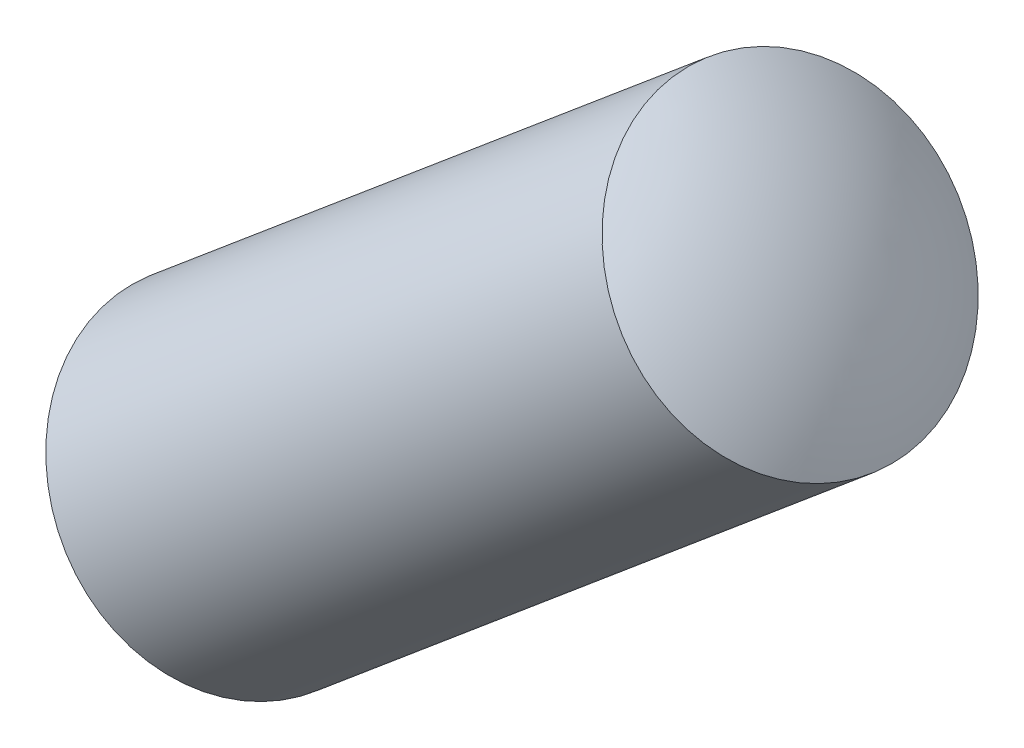
ISO-10303-21;
HEADER;
FILE_DESCRIPTION(('STEP AP214'),'2;1');
FILE_NAME('part.step','',(''),(''),'','','');
FILE_SCHEMA(('AUTOMOTIVE_DESIGN { 1 0 10303 214 1 1 1 1 }'));
ENDSEC;
DATA;
#1=APPLICATION_CONTEXT('core data for automotive mechanical design processes');
#2=APPLICATION_PROTOCOL_DEFINITION('international standard','automotive_design',2000,#1);
#3=PRODUCT_CONTEXT('',#1,'mechanical');
#4=PRODUCT('Part','Part','',(#3));
#5=PRODUCT_RELATED_PRODUCT_CATEGORY('part','',(#4));
#6=PRODUCT_DEFINITION_FORMATION('','',#4);
#7=PRODUCT_DEFINITION_CONTEXT('part definition',#1,'design');
#8=PRODUCT_DEFINITION('design','',#6,#7);
#9=PRODUCT_DEFINITION_SHAPE('','',#8);
#10=(LENGTH_UNIT() NAMED_UNIT(*) SI_UNIT(.MILLI.,.METRE.));
#11=(NAMED_UNIT(*) PLANE_ANGLE_UNIT() SI_UNIT($,.RADIAN.));
#12=(NAMED_UNIT(*) SI_UNIT($,.STERADIAN.) SOLID_ANGLE_UNIT());
#13=UNCERTAINTY_MEASURE_WITH_UNIT(LENGTH_MEASURE(1.E-05),#10,'distance_accuracy_value','');
#14=(GEOMETRIC_REPRESENTATION_CONTEXT(3) GLOBAL_UNCERTAINTY_ASSIGNED_CONTEXT((#13)) GLOBAL_UNIT_ASSIGNED_CONTEXT((#10,
#11,#12)) REPRESENTATION_CONTEXT('',''));
#15=CARTESIAN_POINT('',(0.,0.,0.));
#16=DIRECTION('',(0.,0.,1.));
#17=DIRECTION('',(1.,0.,0.));
#18=AXIS2_PLACEMENT_3D('',#15,#16,#17);
#19=CARTESIAN_POINT('',(17.0908048146491,14.3447583615611,0.6));
#20=DIRECTION('',(0.642889392964112,-0.765959025284144,0.));
#21=DIRECTION('',(0.765959025284144,0.642889392964112,0.));
#22=AXIS2_PLACEMENT_3D('',#19,#20,#21);
#23=SPHERICAL_SURFACE('',#22,2.);
#24=CARTESIAN_POINT('',(17.0908048146491,14.3447583615611,0.6));
#25=DIRECTION('',(-0.765959025284144,-0.642889392964112,0.));
#26=DIRECTION('',(0.,0.,-1.));
#27=AXIS2_PLACEMENT_3D('',#24,#25,#26);
#28=SPHERICAL_SURFACE('',#27,2.);
#29=CARTESIAN_POINT('',(18.4174847629572,15.458275453822,0.599999999999989));
#30=DIRECTION('',(-0.765959025284144,-0.642889392964112,0.));
#31=DIRECTION('',(0.,0.,-1.));
#32=AXIS2_PLACEMENT_3D('',#29,#30,#31);
#33=CIRCLE('',#32,1.);
#34=CARTESIAN_POINT('',(18.4174847629572,15.458275453822,-0.400000000000011));
#35=VERTEX_POINT('',#34);
#36=EDGE_CURVE('E11',#35,#35,#33,.T.);
#37=ORIENTED_EDGE('',*,*,#36,.F.);
#38=EDGE_LOOP('',(#37));
#39=FACE_BOUND('',#38,.T.);
#40=ADVANCED_FACE('F17',(#39),#28,.T.);
#41=CARTESIAN_POINT('',(16.2284127852111,13.6209302323778,0.6));
#42=DIRECTION('',(0.642889392964112,-0.765959025284144,0.));
#43=DIRECTION('',(-0.765959025284144,-0.642889392964112,0.));
#44=AXIS2_PLACEMENT_3D('',#41,#42,#43);
#45=SPHERICAL_SURFACE('',#44,2.);
#46=CARTESIAN_POINT('',(16.2284127852111,13.6209302323778,0.6));
#47=DIRECTION('',(-0.765959025284144,-0.642889392964112,0.));
#48=DIRECTION('',(0.,0.,-1.));
#49=AXIS2_PLACEMENT_3D('',#46,#47,#48);
#50=SPHERICAL_SURFACE('',#49,2.);
#51=CARTESIAN_POINT('',(14.901732836903,12.5074131401168,0.6));
#52=DIRECTION('',(-0.765959025284144,-0.642889392964112,0.));
#53=DIRECTION('',(0.,0.,-1.));
#54=AXIS2_PLACEMENT_3D('',#51,#52,#53);
#55=CIRCLE('',#54,1.);
#56=CARTESIAN_POINT('',(14.901732836903,12.5074131401168,-0.4));
#57=VERTEX_POINT('',#56);
#58=EDGE_CURVE('E20',#57,#57,#55,.T.);
#59=ORIENTED_EDGE('',*,*,#58,.T.);
#60=EDGE_LOOP('',(#59));
#61=FACE_BOUND('',#60,.T.);
#62=ADVANCED_FACE('F39',(#61),#50,.T.);
#63=CARTESIAN_POINT('',(15.7806708184165,13.2451287185431,0.6));
#64=DIRECTION('',(-0.765959025284144,-0.642889392964112,0.));
#65=DIRECTION('',(0.,0.,-1.));
#66=AXIS2_PLACEMENT_3D('',#63,#64,#65);
#67=CYLINDRICAL_SURFACE('',#66,1.);
#68=ORIENTED_EDGE('',*,*,#36,.T.);
#69=EDGE_LOOP('',(#68));
#70=FACE_BOUND('',#69,.T.);
#71=ORIENTED_EDGE('',*,*,#58,.F.);
#72=EDGE_LOOP('',(#71));
#73=FACE_BOUND('',#72,.T.);
#74=ADVANCED_FACE('F51',(#70,#73),#67,.T.);
#75=CLOSED_SHELL('',(#40,#62,#74));
#76=MANIFOLD_SOLID_BREP('B1',#75);
#77=ADVANCED_BREP_SHAPE_REPRESENTATION('',(#18,#76),#14);
#78=SHAPE_DEFINITION_REPRESENTATION(#9,#77);
ENDSEC;
END-ISO-10303-21;
